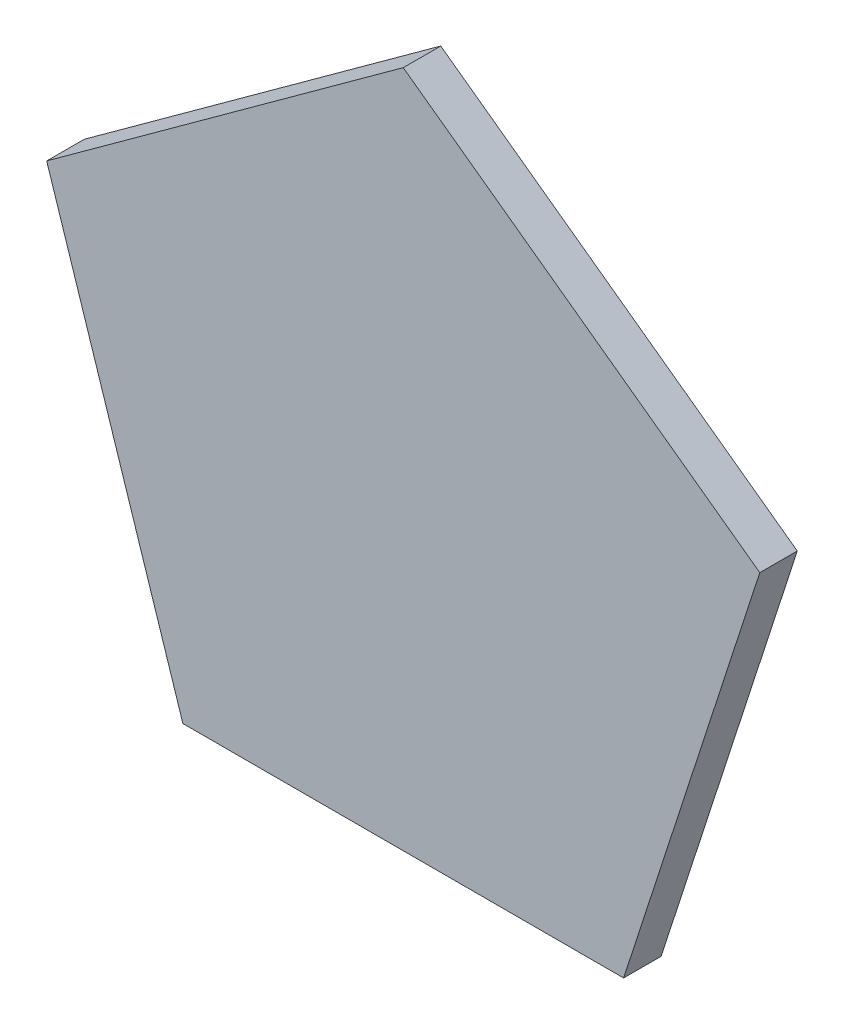
ISO-10303-21;
HEADER;
FILE_DESCRIPTION(('STEP AP214'),'2;1');
FILE_NAME('part.step','',(''),(''),'','','');
FILE_SCHEMA(('AUTOMOTIVE_DESIGN { 1 0 10303 214 1 1 1 1 }'));
ENDSEC;
DATA;
#1=APPLICATION_CONTEXT('core data for automotive mechanical design processes');
#2=APPLICATION_PROTOCOL_DEFINITION('international standard','automotive_design',2000,#1);
#3=PRODUCT_CONTEXT('',#1,'mechanical');
#4=PRODUCT('Part','Part','',(#3));
#5=PRODUCT_RELATED_PRODUCT_CATEGORY('part','',(#4));
#6=PRODUCT_DEFINITION_FORMATION('','',#4);
#7=PRODUCT_DEFINITION_CONTEXT('part definition',#1,'design');
#8=PRODUCT_DEFINITION('design','',#6,#7);
#9=PRODUCT_DEFINITION_SHAPE('','',#8);
#10=(LENGTH_UNIT() NAMED_UNIT(*) SI_UNIT(.MILLI.,.METRE.));
#11=(NAMED_UNIT(*) PLANE_ANGLE_UNIT() SI_UNIT($,.RADIAN.));
#12=(NAMED_UNIT(*) SI_UNIT($,.STERADIAN.) SOLID_ANGLE_UNIT());
#13=UNCERTAINTY_MEASURE_WITH_UNIT(LENGTH_MEASURE(1.E-05),#10,'distance_accuracy_value','');
#14=(GEOMETRIC_REPRESENTATION_CONTEXT(3) GLOBAL_UNCERTAINTY_ASSIGNED_CONTEXT((#13)) GLOBAL_UNIT_ASSIGNED_CONTEXT((#10,
#11,#12)) REPRESENTATION_CONTEXT('',''));
#15=CARTESIAN_POINT('',(0.,0.,0.));
#16=DIRECTION('',(0.,0.,1.));
#17=DIRECTION('',(1.,0.,0.));
#18=AXIS2_PLACEMENT_3D('',#15,#16,#17);
#19=CARTESIAN_POINT('',(7.31378623642007,-2.37639320225012,-1.));
#20=DIRECTION('',(0.95105651629515,-0.309016994374959,0.));
#21=DIRECTION('',(0.309016994374959,0.95105651629515,0.));
#22=AXIS2_PLACEMENT_3D('',#19,#20,#21);
#23=PLANE('',#22);
#24=DIRECTION('',(0.309016994374959,0.95105651629515,0.));
#25=VECTOR('',#24,1.);
#26=CARTESIAN_POINT('',(7.31378623642007,-2.37639320225012,-0.5));
#27=LINE('',#26,#25);
#28=CARTESIAN_POINT('',(5.66389500958776,-7.45423626920161,-0.5));
#29=VERTEX_POINT('',#28);
#30=CARTESIAN_POINT('',(8.96001239476312,2.69016994374932,-0.5));
#31=VERTEX_POINT('',#30);
#32=EDGE_CURVE('E101',#29,#31,#27,.T.);
#33=ORIENTED_EDGE('',*,*,#32,.T.);
#34=DIRECTION('',(0.,0.,1.));
#35=VECTOR('',#34,1.);
#36=CARTESIAN_POINT('',(8.96001239476312,2.69016994374932,-1.));
#37=LINE('',#36,#35);
#38=CARTESIAN_POINT('',(8.96001239476312,2.69016994374932,-1.));
#39=VERTEX_POINT('',#38);
#40=EDGE_CURVE('E237',#39,#31,#37,.T.);
#41=ORIENTED_EDGE('',*,*,#40,.F.);
#42=DIRECTION('',(0.309016994374959,0.95105651629515,0.));
#43=VECTOR('',#42,1.);
#44=CARTESIAN_POINT('',(7.31378623642007,-2.37639320225012,-1.));
#45=LINE('',#44,#43);
#46=CARTESIAN_POINT('',(5.66389500958776,-7.45423626920161,-1.));
#47=VERTEX_POINT('',#46);
#48=EDGE_CURVE('E400',#47,#39,#45,.T.);
#49=ORIENTED_EDGE('',*,*,#48,.F.);
#50=DIRECTION('',(0.,0.,1.));
#51=VECTOR('',#50,1.);
#52=CARTESIAN_POINT('',(5.66389500958776,-7.45423626920161,-1.));
#53=LINE('',#52,#51);
#54=EDGE_CURVE('E245',#47,#29,#53,.T.);
#55=ORIENTED_EDGE('',*,*,#54,.T.);
#56=EDGE_LOOP('',(#33,#41,#49,#55));
#57=FACE_BOUND('',#56,.T.);
#58=ADVANCED_FACE('F83',(#57),#23,.F.);
#59=CARTESIAN_POINT('',(1.81635632001345,-2.5000000000001,-1.));
#60=DIRECTION('',(0.587785252292469,-0.809016994374951,0.));
#61=DIRECTION('',(0.809016994374951,0.587785252292469,0.));
#62=AXIS2_PLACEMENT_3D('',#59,#60,#61);
#63=PLANE('',#62);
#64=ORIENTED_EDGE('',*,*,#40,.T.);
#65=DIRECTION('',(0.809016994374951,0.587785252292469,0.));
#66=VECTOR('',#65,1.);
#67=CARTESIAN_POINT('',(1.81635632001345,-2.5000000000001,-0.5));
#68=LINE('',#67,#66);
#69=CARTESIAN_POINT('',(3.56871075124245,-1.2268399815736,-0.5));
#70=VERTEX_POINT('',#69);
#71=EDGE_CURVE('E224',#70,#31,#68,.T.);
#72=ORIENTED_EDGE('',*,*,#71,.F.);
#73=DIRECTION('',(0.,0.,1.));
#74=VECTOR('',#73,1.);
#75=CARTESIAN_POINT('',(3.56871075124245,-1.2268399815736,-1.));
#76=LINE('',#75,#74);
#77=CARTESIAN_POINT('',(3.56871075124245,-1.2268399815736,-1.));
#78=VERTEX_POINT('',#77);
#79=EDGE_CURVE('E234',#78,#70,#76,.T.);
#80=ORIENTED_EDGE('',*,*,#79,.F.);
#81=DIRECTION('',(0.809016994374951,0.587785252292469,0.));
#82=VECTOR('',#81,1.);
#83=CARTESIAN_POINT('',(1.81635632001345,-2.5000000000001,-1.));
#84=LINE('',#83,#82);
#85=EDGE_CURVE('E405',#78,#39,#84,.T.);
#86=ORIENTED_EDGE('',*,*,#85,.T.);
#87=EDGE_LOOP('',(#64,#72,#80,#86));
#88=FACE_BOUND('',#87,.T.);
#89=ADVANCED_FACE('F232',(#88),#63,.T.);
#90=CARTESIAN_POINT('',(2.83503062375445,0.953835481229622,-1.));
#91=DIRECTION('',(0.947794454323708,0.318881909730271,0.));
#92=DIRECTION('',(-0.318881909730271,0.947794454323708,0.));
#93=AXIS2_PLACEMENT_3D('',#90,#91,#92);
#94=PLANE('',#93);
#95=ORIENTED_EDGE('',*,*,#79,.T.);
#96=DIRECTION('',(-0.318881909730271,0.947794454323708,0.));
#97=VECTOR('',#96,1.);
#98=CARTESIAN_POINT('',(2.83503062375445,0.953835481229622,-0.5));
#99=LINE('',#98,#97);
#100=EDGE_CURVE('E221',#29,#70,#99,.T.);
#101=ORIENTED_EDGE('',*,*,#100,.F.);
#102=ORIENTED_EDGE('',*,*,#54,.F.);
#103=DIRECTION('',(-0.318881909730271,0.947794454323708,0.));
#104=VECTOR('',#103,1.);
#105=CARTESIAN_POINT('',(2.83503062375445,0.953835481229622,-1.));
#106=LINE('',#105,#104);
#107=EDGE_CURVE('E242',#47,#78,#106,.T.);
#108=ORIENTED_EDGE('',*,*,#107,.T.);
#109=EDGE_LOOP('',(#95,#101,#102,#108));
#110=FACE_BOUND('',#109,.T.);
#111=ADVANCED_FACE('F240',(#110),#94,.T.);
#112=CARTESIAN_POINT('',(0.,-7.69016994374951,-1.));
#113=DIRECTION('',(0.,-1.,0.));
#114=DIRECTION('',(1.,0.,0.));
#115=AXIS2_PLACEMENT_3D('',#112,#113,#114);
#116=PLANE('',#115);
#117=DIRECTION('',(1.,0.,0.));
#118=VECTOR('',#117,1.);
#119=CARTESIAN_POINT('',(0.,-7.69016994374951,-0.5));
#120=LINE('',#119,#118);
#121=CARTESIAN_POINT('',(-5.31840267826824,-7.69016994374952,-0.5));
#122=VERTEX_POINT('',#121);
#123=CARTESIAN_POINT('',(5.31509517729066,-7.69016994374951,-0.5));
#124=VERTEX_POINT('',#123);
#125=EDGE_CURVE('E109',#122,#124,#120,.T.);
#126=ORIENTED_EDGE('',*,*,#125,.T.);
#127=DIRECTION('',(0.,0.,1.));
#128=VECTOR('',#127,1.);
#129=CARTESIAN_POINT('',(5.31509517729066,-7.69016994374951,-1.));
#130=LINE('',#129,#128);
#131=CARTESIAN_POINT('',(5.31509517729066,-7.69016994374951,-1.));
#132=VERTEX_POINT('',#131);
#133=EDGE_CURVE('E338',#132,#124,#130,.T.);
#134=ORIENTED_EDGE('',*,*,#133,.F.);
#135=DIRECTION('',(1.,0.,0.));
#136=VECTOR('',#135,1.);
#137=CARTESIAN_POINT('',(0.,-7.69016994374951,-1.));
#138=LINE('',#137,#136);
#139=CARTESIAN_POINT('',(-5.31840267826824,-7.69016994374952,-1.));
#140=VERTEX_POINT('',#139);
#141=EDGE_CURVE('E347',#140,#132,#138,.T.);
#142=ORIENTED_EDGE('',*,*,#141,.F.);
#143=DIRECTION('',(0.,0.,1.));
#144=VECTOR('',#143,1.);
#145=CARTESIAN_POINT('',(-5.31840267826824,-7.69016994374952,-1.));
#146=LINE('',#145,#144);
#147=EDGE_CURVE('E249',#140,#122,#146,.T.);
#148=ORIENTED_EDGE('',*,*,#147,.T.);
#149=EDGE_LOOP('',(#126,#134,#142,#148));
#150=FACE_BOUND('',#149,.T.);
#151=ADVANCED_FACE('F346',(#150),#116,.F.);
#152=CARTESIAN_POINT('',(-1.84743512759684,-2.59914422159366,-1.));
#153=DIRECTION('',(-0.579347736959901,-0.815080486626591,0.));
#154=DIRECTION('',(0.815080486626591,-0.579347736959901,0.));
#155=AXIS2_PLACEMENT_3D('',#152,#153,#154);
#156=PLANE('',#155);
#157=ORIENTED_EDGE('',*,*,#133,.T.);
#158=DIRECTION('',(0.815080486626591,-0.579347736959901,0.));
#159=VECTOR('',#158,1.);
#160=CARTESIAN_POINT('',(-1.84743512759684,-2.59914422159366,-0.5));
#161=LINE('',#160,#159);
#162=CARTESIAN_POINT('',(-0.0173238980589836,-3.89996152321482,-0.5));
#163=VERTEX_POINT('',#162);
#164=EDGE_CURVE('E356',#163,#124,#161,.T.);
#165=ORIENTED_EDGE('',*,*,#164,.F.);
#166=DIRECTION('',(0.,0.,1.));
#167=VECTOR('',#166,1.);
#168=CARTESIAN_POINT('',(-0.0173238980589836,-3.89996152321482,-1.));
#169=LINE('',#168,#167);
#170=CARTESIAN_POINT('',(-0.0173238980589836,-3.89996152321482,-1.));
#171=VERTEX_POINT('',#170);
#172=EDGE_CURVE('E341',#171,#163,#169,.T.);
#173=ORIENTED_EDGE('',*,*,#172,.F.);
#174=DIRECTION('',(0.815080486626591,-0.579347736959901,0.));
#175=VECTOR('',#174,1.);
#176=CARTESIAN_POINT('',(-1.84743512759684,-2.59914422159366,-1.));
#177=LINE('',#176,#175);
#178=EDGE_CURVE('E413',#171,#132,#177,.T.);
#179=ORIENTED_EDGE('',*,*,#178,.T.);
#180=EDGE_LOOP('',(#157,#165,#173,#179));
#181=FACE_BOUND('',#180,.T.);
#182=ADVANCED_FACE('F527',(#181),#156,.T.);
#183=CARTESIAN_POINT('',(1.8393034160758,-2.57249502599921,-1.));
#184=DIRECTION('',(-0.581616484931084,0.813463130360812,0.));
#185=DIRECTION('',(-0.813463130360812,-0.581616484931083,0.));
#186=AXIS2_PLACEMENT_3D('',#183,#184,#185);
#187=PLANE('',#186);
#188=DIRECTION('',(-0.813463130360812,-0.581616484931084,0.));
#189=VECTOR('',#188,1.);
#190=CARTESIAN_POINT('',(1.8393034160758,-2.57249502599921,-0.5));
#191=LINE('',#190,#189);
#192=EDGE_CURVE('E354',#163,#122,#191,.T.);
#193=ORIENTED_EDGE('',*,*,#192,.T.);
#194=ORIENTED_EDGE('',*,*,#147,.F.);
#195=DIRECTION('',(-0.813463130360812,-0.581616484931084,0.));
#196=VECTOR('',#195,1.);
#197=CARTESIAN_POINT('',(1.8393034160758,-2.57249502599921,-1.));
#198=LINE('',#197,#196);
#199=EDGE_CURVE('E410',#171,#140,#198,.T.);
#200=ORIENTED_EDGE('',*,*,#199,.F.);
#201=ORIENTED_EDGE('',*,*,#172,.T.);
#202=EDGE_LOOP('',(#193,#194,#200,#201));
#203=FACE_BOUND('',#202,.T.);
#204=ADVANCED_FACE('F525',(#203),#187,.F.);
#205=CARTESIAN_POINT('',(-7.31378623642003,-2.37639320224998,-1.));
#206=DIRECTION('',(-0.951056516295154,-0.309016994374945,0.));
#207=DIRECTION('',(0.309016994374945,-0.951056516295155,0.));
#208=AXIS2_PLACEMENT_3D('',#205,#206,#207);
#209=PLANE('',#208);
#210=DIRECTION('',(0.309016994374945,-0.951056516295155,0.));
#211=VECTOR('',#210,1.);
#212=CARTESIAN_POINT('',(-7.31378623642003,-2.37639320224998,-0.5));
#213=LINE('',#212,#211);
#214=CARTESIAN_POINT('',(-8.96001239476303,2.69016994374959,-0.5));
#215=VERTEX_POINT('',#214);
#216=CARTESIAN_POINT('',(-5.66486768527724,-7.45124268124505,-0.5));
#217=VERTEX_POINT('',#216);
#218=EDGE_CURVE('E369',#215,#217,#213,.T.);
#219=ORIENTED_EDGE('',*,*,#218,.T.);
#220=DIRECTION('',(0.,0.,1.));
#221=VECTOR('',#220,1.);
#222=CARTESIAN_POINT('',(-5.66486768527724,-7.45124268124505,-1.));
#223=LINE('',#222,#221);
#224=CARTESIAN_POINT('',(-5.66486768527724,-7.45124268124505,-1.));
#225=VERTEX_POINT('',#224);
#226=EDGE_CURVE('E326',#225,#217,#223,.T.);
#227=ORIENTED_EDGE('',*,*,#226,.F.);
#228=DIRECTION('',(0.309016994374945,-0.951056516295155,0.));
#229=VECTOR('',#228,1.);
#230=CARTESIAN_POINT('',(-7.31378623642003,-2.37639320224998,-1.));
#231=LINE('',#230,#229);
#232=CARTESIAN_POINT('',(-8.96001239476303,2.69016994374959,-1.));
#233=VERTEX_POINT('',#232);
#234=EDGE_CURVE('E417',#233,#225,#231,.T.);
#235=ORIENTED_EDGE('',*,*,#234,.F.);
#236=DIRECTION('',(0.,0.,1.));
#237=VECTOR('',#236,1.);
#238=CARTESIAN_POINT('',(-8.96001239476303,2.69016994374959,-1.));
#239=LINE('',#238,#237);
#240=EDGE_CURVE('E334',#233,#215,#239,.T.);
#241=ORIENTED_EDGE('',*,*,#240,.T.);
#242=EDGE_LOOP('',(#219,#227,#235,#241));
#243=FACE_BOUND('',#242,.T.);
#244=ADVANCED_FACE('F518',(#243),#209,.F.);
#245=CARTESIAN_POINT('',(-2.86288835193201,0.954336818324013,-1.));
#246=DIRECTION('',(-0.948679251827622,0.31623990442666,0.));
#247=DIRECTION('',(-0.31623990442666,-0.948679251827622,0.));
#248=AXIS2_PLACEMENT_3D('',#245,#246,#247);
#249=PLANE('',#248);
#250=ORIENTED_EDGE('',*,*,#226,.T.);
#251=DIRECTION('',(-0.31623990442666,-0.948679251827622,0.));
#252=VECTOR('',#251,1.);
#253=CARTESIAN_POINT('',(-2.86288835193201,0.954336818324013,-0.5));
#254=LINE('',#253,#252);
#255=CARTESIAN_POINT('',(-3.58583174175671,-1.21440085384308,-0.5));
#256=VERTEX_POINT('',#255);
#257=EDGE_CURVE('E358',#256,#217,#254,.T.);
#258=ORIENTED_EDGE('',*,*,#257,.F.);
#259=DIRECTION('',(0.,0.,1.));
#260=VECTOR('',#259,1.);
#261=CARTESIAN_POINT('',(-3.58583174175671,-1.21440085384308,-1.));
#262=LINE('',#261,#260);
#263=CARTESIAN_POINT('',(-3.58583174175671,-1.21440085384308,-1.));
#264=VERTEX_POINT('',#263);
#265=EDGE_CURVE('E330',#264,#256,#262,.T.);
#266=ORIENTED_EDGE('',*,*,#265,.F.);
#267=DIRECTION('',(-0.31623990442666,-0.948679251827622,0.));
#268=VECTOR('',#267,1.);
#269=CARTESIAN_POINT('',(-2.86288835193201,0.954336818324013,-1.));
#270=LINE('',#269,#268);
#271=EDGE_CURVE('E424',#264,#225,#270,.T.);
#272=ORIENTED_EDGE('',*,*,#271,.T.);
#273=EDGE_LOOP('',(#250,#258,#266,#272));
#274=FACE_BOUND('',#273,.T.);
#275=ADVANCED_FACE('F515',(#274),#249,.T.);
#276=CARTESIAN_POINT('',(-1.81635632001329,-2.49999999999988,-1.));
#277=DIRECTION('',(-0.587785252292468,-0.809016994374951,0.));
#278=DIRECTION('',(0.809016994374951,-0.587785252292468,0.));
#279=AXIS2_PLACEMENT_3D('',#276,#277,#278);
#280=PLANE('',#279);
#281=ORIENTED_EDGE('',*,*,#265,.T.);
#282=DIRECTION('',(0.809016994374951,-0.587785252292468,0.));
#283=VECTOR('',#282,1.);
#284=CARTESIAN_POINT('',(-1.81635632001329,-2.49999999999988,-0.5));
#285=LINE('',#284,#283);
#286=EDGE_CURVE('E362',#215,#256,#285,.T.);
#287=ORIENTED_EDGE('',*,*,#286,.F.);
#288=ORIENTED_EDGE('',*,*,#240,.F.);
#289=DIRECTION('',(0.809016994374951,-0.587785252292468,0.));
#290=VECTOR('',#289,1.);
#291=CARTESIAN_POINT('',(-1.81635632001329,-2.49999999999988,-1.));
#292=LINE('',#291,#290);
#293=EDGE_CURVE('E420',#233,#264,#292,.T.);
#294=ORIENTED_EDGE('',*,*,#293,.T.);
#295=EDGE_LOOP('',(#281,#287,#288,#294));
#296=FACE_BOUND('',#295,.T.);
#297=ADVANCED_FACE('F513',(#296),#280,.T.);
#298=CARTESIAN_POINT('',(-4.52016848055876,6.22147817412481,-1.));
#299=DIRECTION('',(-0.587785252292469,0.809016994374951,0.));
#300=DIRECTION('',(-0.809016994374951,-0.587785252292469,0.));
#301=AXIS2_PLACEMENT_3D('',#298,#299,#300);
#302=PLANE('',#301);
#303=DIRECTION('',(-0.809016994374951,-0.587785252292469,0.));
#304=VECTOR('',#303,1.);
#305=CARTESIAN_POINT('',(-4.52016848055876,6.22147817412481,-0.5));
#306=LINE('',#305,#304);
#307=CARTESIAN_POINT('',(-0.210923367590645,9.35232801229538,-0.5));
#308=VERTEX_POINT('',#307);
#309=CARTESIAN_POINT('',(-8.83004451626987,3.09016994374958,-0.5));
#310=VERTEX_POINT('',#309);
#311=EDGE_CURVE('E379',#308,#310,#306,.T.);
#312=ORIENTED_EDGE('',*,*,#311,.T.);
#313=DIRECTION('',(0.,0.,1.));
#314=VECTOR('',#313,1.);
#315=CARTESIAN_POINT('',(-8.83004451626987,3.09016994374958,-1.));
#316=LINE('',#315,#314);
#317=CARTESIAN_POINT('',(-8.83004451626987,3.09016994374958,-1.));
#318=VERTEX_POINT('',#317);
#319=EDGE_CURVE('E314',#318,#310,#316,.T.);
#320=ORIENTED_EDGE('',*,*,#319,.F.);
#321=DIRECTION('',(-0.809016994374951,-0.587785252292469,0.));
#322=VECTOR('',#321,1.);
#323=CARTESIAN_POINT('',(-4.52016848055876,6.22147817412481,-1.));
#324=LINE('',#323,#322);
#325=CARTESIAN_POINT('',(-0.210923367590645,9.35232801229538,-1.));
#326=VERTEX_POINT('',#325);
#327=EDGE_CURVE('E428',#326,#318,#324,.T.);
#328=ORIENTED_EDGE('',*,*,#327,.F.);
#329=DIRECTION('',(0.,0.,1.));
#330=VECTOR('',#329,1.);
#331=CARTESIAN_POINT('',(-0.210923367590645,9.35232801229538,-1.));
#332=LINE('',#331,#330);
#333=EDGE_CURVE('E322',#326,#308,#332,.T.);
#334=ORIENTED_EDGE('',*,*,#333,.T.);
#335=EDGE_LOOP('',(#312,#320,#328,#334));
#336=FACE_BOUND('',#335,.T.);
#337=ADVANCED_FACE('F506',(#336),#302,.F.);
#338=CARTESIAN_POINT('',(0.,3.09016994374959,-1.));
#339=DIRECTION('',(0.,1.,0.));
#340=DIRECTION('',(-1.,0.,0.));
#341=AXIS2_PLACEMENT_3D('',#338,#339,#340);
#342=PLANE('',#341);
#343=ORIENTED_EDGE('',*,*,#319,.T.);
#344=DIRECTION('',(-1.,0.,0.));
#345=VECTOR('',#344,1.);
#346=CARTESIAN_POINT('',(0.,3.09016994374959,-0.5));
#347=LINE('',#346,#345);
#348=CARTESIAN_POINT('',(-2.25028201406183,3.09016994374959,-0.5));
#349=VERTEX_POINT('',#348);
#350=EDGE_CURVE('E373',#349,#310,#347,.T.);
#351=ORIENTED_EDGE('',*,*,#350,.F.);
#352=DIRECTION('',(0.,0.,1.));
#353=VECTOR('',#352,1.);
#354=CARTESIAN_POINT('',(-2.25028201406183,3.09016994374959,-1.));
#355=LINE('',#354,#353);
#356=CARTESIAN_POINT('',(-2.25028201406183,3.09016994374959,-1.));
#357=VERTEX_POINT('',#356);
#358=EDGE_CURVE('E318',#357,#349,#355,.T.);
#359=ORIENTED_EDGE('',*,*,#358,.F.);
#360=DIRECTION('',(-1.,0.,0.));
#361=VECTOR('',#360,1.);
#362=CARTESIAN_POINT('',(0.,3.09016994374959,-1.));
#363=LINE('',#362,#361);
#364=EDGE_CURVE('E435',#357,#318,#363,.T.);
#365=ORIENTED_EDGE('',*,*,#364,.T.);
#366=EDGE_LOOP('',(#343,#351,#359,#365));
#367=FACE_BOUND('',#366,.T.);
#368=ADVANCED_FACE('F502',(#367),#342,.T.);
#369=CARTESIAN_POINT('',(-2.94436801056651,0.958874288227026,-1.));
#370=DIRECTION('',(-0.950848342890336,0.309656953454468,0.));
#371=DIRECTION('',(-0.309656953454468,-0.950848342890336,0.));
#372=AXIS2_PLACEMENT_3D('',#369,#370,#371);
#373=PLANE('',#372);
#374=ORIENTED_EDGE('',*,*,#358,.T.);
#375=DIRECTION('',(-0.309656953454468,-0.950848342890336,0.));
#376=VECTOR('',#375,1.);
#377=CARTESIAN_POINT('',(-2.94436801056651,0.958874288227026,-0.5));
#378=LINE('',#377,#376);
#379=EDGE_CURVE('E376',#308,#349,#378,.T.);
#380=ORIENTED_EDGE('',*,*,#379,.F.);
#381=ORIENTED_EDGE('',*,*,#333,.F.);
#382=DIRECTION('',(-0.309656953454468,-0.950848342890336,0.));
#383=VECTOR('',#382,1.);
#384=CARTESIAN_POINT('',(-2.94436801056651,0.958874288227026,-1.));
#385=LINE('',#384,#383);
#386=EDGE_CURVE('E431',#326,#357,#385,.T.);
#387=ORIENTED_EDGE('',*,*,#386,.T.);
#388=EDGE_LOOP('',(#374,#380,#381,#387));
#389=FACE_BOUND('',#388,.T.);
#390=ADVANCED_FACE('F505',(#389),#373,.T.);
#391=CARTESIAN_POINT('',(4.5201684805588,6.22147817412468,-1.));
#392=DIRECTION('',(0.58778525229248,0.809016994374942,0.));
#393=DIRECTION('',(-0.809016994374942,0.58778525229248,0.));
#394=AXIS2_PLACEMENT_3D('',#391,#392,#393);
#395=PLANE('',#394);
#396=DIRECTION('',(-0.809016994374942,0.58778525229248,0.));
#397=VECTOR('',#396,1.);
#398=CARTESIAN_POINT('',(4.5201684805588,6.22147817412468,-0.5));
#399=LINE('',#398,#397);
#400=CARTESIAN_POINT('',(8.83004451626996,3.09016994374931,-0.5));
#401=VERTEX_POINT('',#400);
#402=CARTESIAN_POINT('',(0.209662689818735,9.35324394831077,-0.5));
#403=VERTEX_POINT('',#402);
#404=EDGE_CURVE('E286',#401,#403,#399,.T.);
#405=ORIENTED_EDGE('',*,*,#404,.T.);
#406=DIRECTION('',(0.,0.,1.));
#407=VECTOR('',#406,1.);
#408=CARTESIAN_POINT('',(0.209662689818733,9.35324394831077,-1.));
#409=LINE('',#408,#407);
#410=CARTESIAN_POINT('',(0.209662689818733,9.35324394831077,-1.));
#411=VERTEX_POINT('',#410);
#412=EDGE_CURVE('E251',#411,#403,#409,.T.);
#413=ORIENTED_EDGE('',*,*,#412,.F.);
#414=DIRECTION('',(-0.809016994374942,0.58778525229248,0.));
#415=VECTOR('',#414,1.);
#416=CARTESIAN_POINT('',(4.5201684805588,6.22147817412468,-1.));
#417=LINE('',#416,#415);
#418=CARTESIAN_POINT('',(8.83004451626996,3.09016994374931,-1.));
#419=VERTEX_POINT('',#418);
#420=EDGE_CURVE('E301',#419,#411,#417,.T.);
#421=ORIENTED_EDGE('',*,*,#420,.F.);
#422=DIRECTION('',(0.,0.,1.));
#423=VECTOR('',#422,1.);
#424=CARTESIAN_POINT('',(8.83004451626996,3.09016994374931,-1.));
#425=LINE('',#424,#423);
#426=EDGE_CURVE('E87',#419,#401,#425,.T.);
#427=ORIENTED_EDGE('',*,*,#426,.T.);
#428=EDGE_LOOP('',(#405,#413,#421,#427));
#429=FACE_BOUND('',#428,.T.);
#430=ADVANCED_FACE('F85',(#429),#395,.F.);
#431=CARTESIAN_POINT('',(2.93347918839052,0.950963095836287,-1.));
#432=DIRECTION('',(0.951264258981894,0.308376895346634,0.));
#433=DIRECTION('',(-0.308376895346634,0.951264258981894,0.));
#434=AXIS2_PLACEMENT_3D('',#431,#432,#433);
#435=PLANE('',#434);
#436=ORIENTED_EDGE('',*,*,#412,.T.);
#437=DIRECTION('',(-0.308376895346634,0.951264258981894,0.));
#438=VECTOR('',#437,1.);
#439=CARTESIAN_POINT('',(2.93347918839052,0.950963095836287,-0.5));
#440=LINE('',#439,#438);
#441=CARTESIAN_POINT('',(2.24,3.09016994374931,-0.5));
#442=VERTEX_POINT('',#441);
#443=EDGE_CURVE('E383',#442,#403,#440,.T.);
#444=ORIENTED_EDGE('',*,*,#443,.F.);
#445=DIRECTION('',(0.,0.,1.));
#446=VECTOR('',#445,1.);
#447=CARTESIAN_POINT('',(2.24,3.09016994374931,-1.));
#448=LINE('',#447,#446);
#449=CARTESIAN_POINT('',(2.24,3.09016994374931,-1.));
#450=VERTEX_POINT('',#449);
#451=EDGE_CURVE('E257',#450,#442,#448,.T.);
#452=ORIENTED_EDGE('',*,*,#451,.F.);
#453=DIRECTION('',(-0.308376895346634,0.951264258981894,0.));
#454=VECTOR('',#453,1.);
#455=CARTESIAN_POINT('',(2.93347918839052,0.950963095836287,-1.));
#456=LINE('',#455,#454);
#457=EDGE_CURVE('E396',#450,#411,#456,.T.);
#458=ORIENTED_EDGE('',*,*,#457,.T.);
#459=EDGE_LOOP('',(#436,#444,#452,#458));
#460=FACE_BOUND('',#459,.T.);
#461=ADVANCED_FACE('F488',(#460),#435,.T.);
#462=CARTESIAN_POINT('',(0.,3.09016994374931,-1.));
#463=DIRECTION('',(0.,1.,0.));
#464=DIRECTION('',(-1.,0.,0.));
#465=AXIS2_PLACEMENT_3D('',#462,#463,#464);
#466=PLANE('',#465);
#467=ORIENTED_EDGE('',*,*,#451,.T.);
#468=DIRECTION('',(-1.,0.,0.));
#469=VECTOR('',#468,1.);
#470=CARTESIAN_POINT('',(0.,3.09016994374931,-0.5));
#471=LINE('',#470,#469);
#472=EDGE_CURVE('E386',#401,#442,#471,.T.);
#473=ORIENTED_EDGE('',*,*,#472,.F.);
#474=ORIENTED_EDGE('',*,*,#426,.F.);
#475=DIRECTION('',(-1.,0.,0.));
#476=VECTOR('',#475,1.);
#477=CARTESIAN_POINT('',(0.,3.09016994374931,-1.));
#478=LINE('',#477,#476);
#479=EDGE_CURVE('E393',#419,#450,#478,.T.);
#480=ORIENTED_EDGE('',*,*,#479,.T.);
#481=EDGE_LOOP('',(#467,#473,#474,#480));
#482=FACE_BOUND('',#481,.T.);
#483=ADVANCED_FACE('F490',(#482),#466,.T.);
#484=CARTESIAN_POINT('',(7.69420884293814,-2.5000000000001,-1.));
#485=DIRECTION('',(0.95105651629515,-0.309016994374958,0.));
#486=DIRECTION('',(0.309016994374958,0.95105651629515,0.));
#487=AXIS2_PLACEMENT_3D('',#484,#485,#486);
#488=PLANE('',#487);
#489=DIRECTION('',(0.309016994374958,0.95105651629515,0.));
#490=VECTOR('',#489,1.);
#491=CARTESIAN_POINT('',(7.69420884293814,-2.5000000000001,0.));
#492=LINE('',#491,#490);
#493=CARTESIAN_POINT('',(5.87785252292468,-8.09016994374951,0.));
#494=VERTEX_POINT('',#493);
#495=CARTESIAN_POINT('',(9.51056516295159,3.09016994374932,0.));
#496=VERTEX_POINT('',#495);
#497=EDGE_CURVE('E281',#494,#496,#492,.T.);
#498=ORIENTED_EDGE('',*,*,#497,.F.);
#499=DIRECTION('',(0.,0.,1.));
#500=VECTOR('',#499,1.);
#501=CARTESIAN_POINT('',(5.87785252292468,-8.09016994374951,-1.));
#502=LINE('',#501,#500);
#503=CARTESIAN_POINT('',(5.87785252292468,-8.09016994374951,-1.));
#504=VERTEX_POINT('',#503);
#505=EDGE_CURVE('E12',#504,#494,#502,.T.);
#506=ORIENTED_EDGE('',*,*,#505,.F.);
#507=DIRECTION('',(0.309016994374958,0.95105651629515,0.));
#508=VECTOR('',#507,1.);
#509=CARTESIAN_POINT('',(7.69420884293814,-2.5000000000001,-1.));
#510=LINE('',#509,#508);
#511=CARTESIAN_POINT('',(9.51056516295159,3.09016994374932,-1.));
#512=VERTEX_POINT('',#511);
#513=EDGE_CURVE('E439',#504,#512,#510,.T.);
#514=ORIENTED_EDGE('',*,*,#513,.T.);
#515=DIRECTION('',(0.,0.,1.));
#516=VECTOR('',#515,1.);
#517=CARTESIAN_POINT('',(9.51056516295159,3.09016994374932,-1.));
#518=LINE('',#517,#516);
#519=EDGE_CURVE('E311',#512,#496,#518,.T.);
#520=ORIENTED_EDGE('',*,*,#519,.T.);
#521=EDGE_LOOP('',(#498,#506,#514,#520));
#522=FACE_BOUND('',#521,.T.);
#523=ADVANCED_FACE('F463',(#522),#488,.T.);
#524=CARTESIAN_POINT('',(0.,-8.09016994374951,-1.));
#525=DIRECTION('',(0.,-1.,0.));
#526=DIRECTION('',(0.,0.,-1.));
#527=AXIS2_PLACEMENT_3D('',#524,#525,#526);
#528=PLANE('',#527);
#529=DIRECTION('',(1.,0.,0.));
#530=VECTOR('',#529,1.);
#531=CARTESIAN_POINT('',(0.,-8.09016994374951,0.));
#532=LINE('',#531,#530);
#533=CARTESIAN_POINT('',(-5.87785252292468,-8.09016994374951,0.));
#534=VERTEX_POINT('',#533);
#535=EDGE_CURVE('E298',#534,#494,#532,.T.);
#536=ORIENTED_EDGE('',*,*,#535,.F.);
#537=DIRECTION('',(0.,0.,1.));
#538=VECTOR('',#537,1.);
#539=CARTESIAN_POINT('',(-5.87785252292468,-8.09016994374951,-1.));
#540=LINE('',#539,#538);
#541=CARTESIAN_POINT('',(-5.87785252292468,-8.09016994374951,-1.));
#542=VERTEX_POINT('',#541);
#543=EDGE_CURVE('E93',#542,#534,#540,.T.);
#544=ORIENTED_EDGE('',*,*,#543,.F.);
#545=DIRECTION('',(1.,0.,0.));
#546=VECTOR('',#545,1.);
#547=CARTESIAN_POINT('',(0.,-8.09016994374951,-1.));
#548=LINE('',#547,#546);
#549=EDGE_CURVE('E265',#542,#504,#548,.T.);
#550=ORIENTED_EDGE('',*,*,#549,.T.);
#551=ORIENTED_EDGE('',*,*,#505,.T.);
#552=EDGE_LOOP('',(#536,#544,#550,#551));
#553=FACE_BOUND('',#552,.T.);
#554=ADVANCED_FACE('F465',(#553),#528,.T.);
#555=CARTESIAN_POINT('',(-7.69420884293809,-2.49999999999997,-1.));
#556=DIRECTION('',(-0.951056516295154,-0.309016994374945,0.));
#557=DIRECTION('',(0.309016994374945,-0.951056516295154,0.));
#558=AXIS2_PLACEMENT_3D('',#555,#556,#557);
#559=PLANE('',#558);
#560=DIRECTION('',(0.309016994374945,-0.951056516295154,0.));
#561=VECTOR('',#560,1.);
#562=CARTESIAN_POINT('',(-7.69420884293809,-2.49999999999997,0.));
#563=LINE('',#562,#561);
#564=CARTESIAN_POINT('',(-9.5105651629515,3.09016994374958,0.));
#565=VERTEX_POINT('',#564);
#566=EDGE_CURVE('E294',#565,#534,#563,.T.);
#567=ORIENTED_EDGE('',*,*,#566,.F.);
#568=DIRECTION('',(0.,0.,1.));
#569=VECTOR('',#568,1.);
#570=CARTESIAN_POINT('',(-9.5105651629515,3.09016994374958,-1.));
#571=LINE('',#570,#569);
#572=CARTESIAN_POINT('',(-9.5105651629515,3.09016994374958,-1.));
#573=VERTEX_POINT('',#572);
#574=EDGE_CURVE('E305',#573,#565,#571,.T.);
#575=ORIENTED_EDGE('',*,*,#574,.F.);
#576=DIRECTION('',(0.309016994374945,-0.951056516295154,0.));
#577=VECTOR('',#576,1.);
#578=CARTESIAN_POINT('',(-7.69420884293809,-2.49999999999997,-1.));
#579=LINE('',#578,#577);
#580=EDGE_CURVE('E271',#573,#542,#579,.T.);
#581=ORIENTED_EDGE('',*,*,#580,.T.);
#582=ORIENTED_EDGE('',*,*,#543,.T.);
#583=EDGE_LOOP('',(#567,#575,#581,#582));
#584=FACE_BOUND('',#583,.T.);
#585=ADVANCED_FACE('F469',(#584),#559,.T.);
#586=CARTESIAN_POINT('',(-4.75528258147575,6.54508497187479,-1.));
#587=DIRECTION('',(-0.587785252292469,0.809016994374951,0.));
#588=DIRECTION('',(-0.809016994374951,-0.587785252292469,0.));
#589=AXIS2_PLACEMENT_3D('',#586,#587,#588);
#590=PLANE('',#589);
#591=DIRECTION('',(-0.809016994374951,-0.587785252292469,0.));
#592=VECTOR('',#591,1.);
#593=CARTESIAN_POINT('',(-4.75528258147575,6.54508497187479,0.));
#594=LINE('',#593,#592);
#595=CARTESIAN_POINT('',(0.,10.,0.));
#596=VERTEX_POINT('',#595);
#597=EDGE_CURVE('E290',#596,#565,#594,.T.);
#598=ORIENTED_EDGE('',*,*,#597,.F.);
#599=DIRECTION('',(0.,0.,1.));
#600=VECTOR('',#599,1.);
#601=CARTESIAN_POINT('',(0.,10.,-1.));
#602=LINE('',#601,#600);
#603=CARTESIAN_POINT('',(0.,10.,-1.));
#604=VERTEX_POINT('',#603);
#605=EDGE_CURVE('E308',#604,#596,#602,.T.);
#606=ORIENTED_EDGE('',*,*,#605,.F.);
#607=DIRECTION('',(-0.809016994374951,-0.587785252292469,0.));
#608=VECTOR('',#607,1.);
#609=CARTESIAN_POINT('',(-4.75528258147575,6.54508497187479,-1.));
#610=LINE('',#609,#608);
#611=EDGE_CURVE('E277',#604,#573,#610,.T.);
#612=ORIENTED_EDGE('',*,*,#611,.T.);
#613=ORIENTED_EDGE('',*,*,#574,.T.);
#614=EDGE_LOOP('',(#598,#606,#612,#613));
#615=FACE_BOUND('',#614,.T.);
#616=ADVANCED_FACE('F451',(#615),#590,.T.);
#617=CARTESIAN_POINT('',(4.75528258147579,6.54508497187466,-1.));
#618=DIRECTION('',(0.58778525229248,0.809016994374942,0.));
#619=DIRECTION('',(-0.809016994374943,0.58778525229248,0.));
#620=AXIS2_PLACEMENT_3D('',#617,#618,#619);
#621=PLANE('',#620);
#622=DIRECTION('',(-0.809016994374943,0.58778525229248,0.));
#623=VECTOR('',#622,1.);
#624=CARTESIAN_POINT('',(4.75528258147579,6.54508497187466,0.));
#625=LINE('',#624,#623);
#626=EDGE_CURVE('E285',#496,#596,#625,.T.);
#627=ORIENTED_EDGE('',*,*,#626,.F.);
#628=ORIENTED_EDGE('',*,*,#519,.F.);
#629=DIRECTION('',(-0.809016994374943,0.58778525229248,0.));
#630=VECTOR('',#629,1.);
#631=CARTESIAN_POINT('',(4.75528258147579,6.54508497187466,-1.));
#632=LINE('',#631,#630);
#633=EDGE_CURVE('E443',#512,#604,#632,.T.);
#634=ORIENTED_EDGE('',*,*,#633,.T.);
#635=ORIENTED_EDGE('',*,*,#605,.T.);
#636=EDGE_LOOP('',(#627,#628,#634,#635));
#637=FACE_BOUND('',#636,.T.);
#638=ADVANCED_FACE('F460',(#637),#621,.T.);
#639=CARTESIAN_POINT('',(0.,0.,-1.));
#640=DIRECTION('',(0.,0.,1.));
#641=DIRECTION('',(1.,0.,0.));
#642=AXIS2_PLACEMENT_3D('',#639,#640,#641);
#643=PLANE('',#642);
#644=ORIENTED_EDGE('',*,*,#420,.T.);
#645=ORIENTED_EDGE('',*,*,#457,.F.);
#646=ORIENTED_EDGE('',*,*,#479,.F.);
#647=EDGE_LOOP('',(#644,#645,#646));
#648=FACE_BOUND('',#647,.T.);
#649=ORIENTED_EDGE('',*,*,#48,.T.);
#650=ORIENTED_EDGE('',*,*,#85,.F.);
#651=ORIENTED_EDGE('',*,*,#107,.F.);
#652=EDGE_LOOP('',(#649,#650,#651));
#653=FACE_BOUND('',#652,.T.);
#654=ORIENTED_EDGE('',*,*,#141,.T.);
#655=ORIENTED_EDGE('',*,*,#178,.F.);
#656=ORIENTED_EDGE('',*,*,#199,.T.);
#657=EDGE_LOOP('',(#654,#655,#656));
#658=FACE_BOUND('',#657,.T.);
#659=ORIENTED_EDGE('',*,*,#234,.T.);
#660=ORIENTED_EDGE('',*,*,#271,.F.);
#661=ORIENTED_EDGE('',*,*,#293,.F.);
#662=EDGE_LOOP('',(#659,#660,#661));
#663=FACE_BOUND('',#662,.T.);
#664=ORIENTED_EDGE('',*,*,#327,.T.);
#665=ORIENTED_EDGE('',*,*,#364,.F.);
#666=ORIENTED_EDGE('',*,*,#386,.F.);
#667=EDGE_LOOP('',(#664,#665,#666));
#668=FACE_BOUND('',#667,.T.);
#669=ORIENTED_EDGE('',*,*,#513,.F.);
#670=ORIENTED_EDGE('',*,*,#549,.F.);
#671=ORIENTED_EDGE('',*,*,#580,.F.);
#672=ORIENTED_EDGE('',*,*,#611,.F.);
#673=ORIENTED_EDGE('',*,*,#633,.F.);
#674=EDGE_LOOP('',(#669,#670,#671,#672,#673));
#675=FACE_BOUND('',#674,.T.);
#676=ADVANCED_FACE('F457',(#648,#653,#658,#663,#668,#675),#643,.F.);
#677=CARTESIAN_POINT('',(0.,0.,0.));
#678=DIRECTION('',(0.,0.,1.));
#679=DIRECTION('',(1.,0.,0.));
#680=AXIS2_PLACEMENT_3D('',#677,#678,#679);
#681=PLANE('',#680);
#682=ORIENTED_EDGE('',*,*,#497,.T.);
#683=ORIENTED_EDGE('',*,*,#626,.T.);
#684=ORIENTED_EDGE('',*,*,#597,.T.);
#685=ORIENTED_EDGE('',*,*,#566,.T.);
#686=ORIENTED_EDGE('',*,*,#535,.T.);
#687=EDGE_LOOP('',(#682,#683,#684,#685,#686));
#688=FACE_BOUND('',#687,.T.);
#689=ADVANCED_FACE('F467',(#688),#681,.T.);
#690=CARTESIAN_POINT('',(0.,0.,-0.5));
#691=DIRECTION('',(0.,0.,1.));
#692=DIRECTION('',(1.,0.,0.));
#693=AXIS2_PLACEMENT_3D('',#690,#691,#692);
#694=PLANE('',#693);
#695=ORIENTED_EDGE('',*,*,#443,.T.);
#696=ORIENTED_EDGE('',*,*,#404,.F.);
#697=ORIENTED_EDGE('',*,*,#472,.T.);
#698=EDGE_LOOP('',(#695,#696,#697));
#699=FACE_BOUND('',#698,.T.);
#700=ADVANCED_FACE('F553',(#699),#694,.F.);
#701=CARTESIAN_POINT('',(0.,0.,-0.5));
#702=DIRECTION('',(0.,0.,1.));
#703=DIRECTION('',(1.,0.,0.));
#704=AXIS2_PLACEMENT_3D('',#701,#702,#703);
#705=PLANE('',#704);
#706=ORIENTED_EDGE('',*,*,#350,.T.);
#707=ORIENTED_EDGE('',*,*,#311,.F.);
#708=ORIENTED_EDGE('',*,*,#379,.T.);
#709=EDGE_LOOP('',(#706,#707,#708));
#710=FACE_BOUND('',#709,.T.);
#711=ADVANCED_FACE('F558',(#710),#705,.F.);
#712=CARTESIAN_POINT('',(0.,0.,-0.5));
#713=DIRECTION('',(0.,0.,1.));
#714=DIRECTION('',(1.,0.,0.));
#715=AXIS2_PLACEMENT_3D('',#712,#713,#714);
#716=PLANE('',#715);
#717=ORIENTED_EDGE('',*,*,#257,.T.);
#718=ORIENTED_EDGE('',*,*,#218,.F.);
#719=ORIENTED_EDGE('',*,*,#286,.T.);
#720=EDGE_LOOP('',(#717,#718,#719));
#721=FACE_BOUND('',#720,.T.);
#722=ADVANCED_FACE('F568',(#721),#716,.F.);
#723=CARTESIAN_POINT('',(0.,0.,-0.5));
#724=DIRECTION('',(0.,0.,1.));
#725=DIRECTION('',(1.,0.,0.));
#726=AXIS2_PLACEMENT_3D('',#723,#724,#725);
#727=PLANE('',#726);
#728=ORIENTED_EDGE('',*,*,#164,.T.);
#729=ORIENTED_EDGE('',*,*,#125,.F.);
#730=ORIENTED_EDGE('',*,*,#192,.F.);
#731=EDGE_LOOP('',(#728,#729,#730));
#732=FACE_BOUND('',#731,.T.);
#733=ADVANCED_FACE('F353',(#732),#727,.F.);
#734=CARTESIAN_POINT('',(0.,0.,-0.5));
#735=DIRECTION('',(0.,0.,1.));
#736=DIRECTION('',(1.,0.,0.));
#737=AXIS2_PLACEMENT_3D('',#734,#735,#736);
#738=PLANE('',#737);
#739=ORIENTED_EDGE('',*,*,#71,.T.);
#740=ORIENTED_EDGE('',*,*,#32,.F.);
#741=ORIENTED_EDGE('',*,*,#100,.T.);
#742=EDGE_LOOP('',(#739,#740,#741));
#743=FACE_BOUND('',#742,.T.);
#744=ADVANCED_FACE('F223',(#743),#738,.F.);
#745=CLOSED_SHELL('',(#58,#89,#111,#151,#182,#204,#244,#275,#297,#337,#368,#390,#430,#461,#483,
#523,#554,#585,#616,#638,#676,#689,#700,#711,#722,#733,#744));
#746=MANIFOLD_SOLID_BREP('B2',#745);
#747=ADVANCED_BREP_SHAPE_REPRESENTATION('',(#18,#746),#14);
#748=SHAPE_DEFINITION_REPRESENTATION(#9,#747);
ENDSEC;
END-ISO-10303-21;
